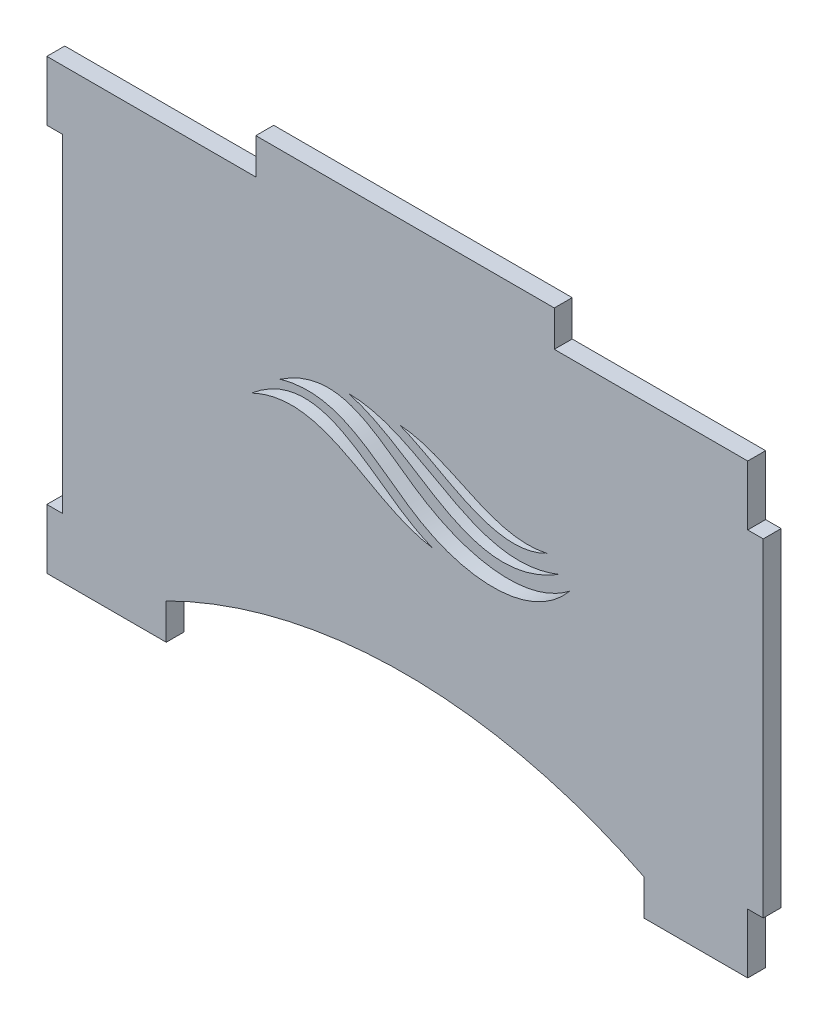
ISO-10303-21;
HEADER;
FILE_DESCRIPTION(('STEP AP214'),'2;1');
FILE_NAME('part.step','',(''),(''),'','','');
FILE_SCHEMA(('AUTOMOTIVE_DESIGN { 1 0 10303 214 1 1 1 1 }'));
ENDSEC;
DATA;
#1=APPLICATION_CONTEXT('core data for automotive mechanical design processes');
#2=APPLICATION_PROTOCOL_DEFINITION('international standard','automotive_design',2000,#1);
#3=PRODUCT_CONTEXT('',#1,'mechanical');
#4=PRODUCT('Part','Part','',(#3));
#5=PRODUCT_RELATED_PRODUCT_CATEGORY('part','',(#4));
#6=PRODUCT_DEFINITION_FORMATION('','',#4);
#7=PRODUCT_DEFINITION_CONTEXT('part definition',#1,'design');
#8=PRODUCT_DEFINITION('design','',#6,#7);
#9=PRODUCT_DEFINITION_SHAPE('','',#8);
#10=(LENGTH_UNIT() NAMED_UNIT(*) SI_UNIT(.MILLI.,.METRE.));
#11=(NAMED_UNIT(*) PLANE_ANGLE_UNIT() SI_UNIT($,.RADIAN.));
#12=(NAMED_UNIT(*) SI_UNIT($,.STERADIAN.) SOLID_ANGLE_UNIT());
#13=UNCERTAINTY_MEASURE_WITH_UNIT(LENGTH_MEASURE(1.E-05),#10,'distance_accuracy_value','');
#14=(GEOMETRIC_REPRESENTATION_CONTEXT(3) GLOBAL_UNCERTAINTY_ASSIGNED_CONTEXT((#13)) GLOBAL_UNIT_ASSIGNED_CONTEXT((#10,
#11,#12)) REPRESENTATION_CONTEXT('',''));
#15=CARTESIAN_POINT('',(0.,0.,0.));
#16=DIRECTION('',(0.,0.,1.));
#17=DIRECTION('',(1.,0.,0.));
#18=AXIS2_PLACEMENT_3D('',#15,#16,#17);
#19=CARTESIAN_POINT('',(0.,0.,3.));
#20=DIRECTION('',(0.,0.,-1.));
#21=DIRECTION('',(-1.,0.,0.));
#22=AXIS2_PLACEMENT_3D('',#19,#20,#21);
#23=PLANE('',#22);
#24=CARTESIAN_POINT('',(-24.4333985265473,-31.7116357940053,3.));
#25=CARTESIAN_POINT('',(-12.0868755885645,-21.3752233639132,3.));
#26=CARTESIAN_POINT('',(-4.14019309824819,-35.3582297749606,3.));
#27=CARTESIAN_POINT('',(5.97275965241098,-39.0224717089516,3.));
#28=B_SPLINE_CURVE_WITH_KNOTS('',3,(#24,#25,#26,#27),.UNSPECIFIED.,.F.,.F.,(4,4),(0.,1.),.UNSPECIFIED.);
#29=CARTESIAN_POINT('',(-24.4333985265473,-31.7116357940053,3.));
#30=VERTEX_POINT('',#29);
#31=CARTESIAN_POINT('',(5.97275965241098,-39.0224717089516,3.));
#32=VERTEX_POINT('',#31);
#33=EDGE_CURVE('E406',#30,#32,#28,.T.);
#34=ORIENTED_EDGE('',*,*,#33,.T.);
#35=CARTESIAN_POINT('',(5.97275965241098,-39.0224717089516,3.));
#36=CARTESIAN_POINT('',(-4.78665127300127,-37.542126637079,3.));
#37=CARTESIAN_POINT('',(-12.266801911344,-25.8915798457805,3.));
#38=CARTESIAN_POINT('',(-24.4333985265473,-31.7116357940053,3.));
#39=B_SPLINE_CURVE_WITH_KNOTS('',3,(#35,#36,#37,#38),.UNSPECIFIED.,.F.,.F.,(4,4),(0.,1.),.UNSPECIFIED.);
#40=EDGE_CURVE('E413',#32,#30,#39,.T.);
#41=ORIENTED_EDGE('',*,*,#40,.T.);
#42=EDGE_LOOP('',(#34,#41));
#43=FACE_BOUND('',#42,.T.);
#44=CARTESIAN_POINT('',(25.12591934899,-30.1784115919172,3.));
#45=CARTESIAN_POINT('',(16.4033129168845,-34.7892645078574,3.));
#46=CARTESIAN_POINT('',(7.80204591224323,-26.7598485053256,3.));
#47=CARTESIAN_POINT('',(0.374797507402158,-23.9122940143284,2.99999999999998));
#48=B_SPLINE_CURVE_WITH_KNOTS('',3,(#44,#45,#46,#47),.UNSPECIFIED.,.F.,.F.,(4,4),(0.,1.),.UNSPECIFIED.);
#49=CARTESIAN_POINT('',(25.12591934899,-30.1784115919172,3.));
#50=VERTEX_POINT('',#49);
#51=CARTESIAN_POINT('',(0.374797507402158,-23.9122940143284,2.99999999999998));
#52=VERTEX_POINT('',#51);
#53=EDGE_CURVE('E664',#50,#52,#48,.T.);
#54=ORIENTED_EDGE('',*,*,#53,.T.);
#55=CARTESIAN_POINT('',(0.374797507402158,-23.9122940143284,2.99999999999998));
#56=CARTESIAN_POINT('',(9.18016719220731,-24.4868190879793,3.));
#57=CARTESIAN_POINT('',(15.7739483838646,-32.3987665956965,3.));
#58=CARTESIAN_POINT('',(25.12591934899,-30.1784115919172,3.));
#59=B_SPLINE_CURVE_WITH_KNOTS('',3,(#55,#56,#57,#58),.UNSPECIFIED.,.F.,.F.,(4,4),(0.,1.),.UNSPECIFIED.);
#60=EDGE_CURVE('E671',#52,#50,#59,.T.);
#61=ORIENTED_EDGE('',*,*,#60,.T.);
#62=EDGE_LOOP('',(#54,#61));
#63=FACE_BOUND('',#62,.T.);
#64=CARTESIAN_POINT('',(28.893422577764,-33.7724686922463,3.00000000000003));
#65=CARTESIAN_POINT('',(22.7928815914827,-41.1921870334598,2.99999999999998));
#66=CARTESIAN_POINT('',(2.1411008927285,-40.4780917336509,3.));
#67=CARTESIAN_POINT('',(-8.73692936120792,-24.1378576761832,3.));
#68=CARTESIAN_POINT('',(-19.6338763660233,-27.3095771584664,3.));
#69=B_SPLINE_CURVE_WITH_KNOTS('',3,(#64,#65,#66,#67,#68),.UNSPECIFIED.,.F.,.F.,(4,1,4),(0.,
0.483960526883397,1.),.UNSPECIFIED.);
#70=CARTESIAN_POINT('',(28.893422577764,-33.7724686922463,3.00000000000003));
#71=VERTEX_POINT('',#70);
#72=CARTESIAN_POINT('',(-19.6338763660233,-27.3095771584664,3.));
#73=VERTEX_POINT('',#72);
#74=EDGE_CURVE('E712',#71,#73,#69,.T.);
#75=ORIENTED_EDGE('',*,*,#74,.T.);
#76=CARTESIAN_POINT('',(-19.6338763660233,-27.3095771584664,3.));
#77=CARTESIAN_POINT('',(-9.02342857661063,-20.1867869281244,3.00000000000003));
#78=CARTESIAN_POINT('',(2.40422951193817,-35.7492100264245,3.));
#79=CARTESIAN_POINT('',(21.9216727795484,-39.1581539151279,2.99999999999998));
#80=CARTESIAN_POINT('',(28.8934225777639,-33.7724686922463,3.));
#81=B_SPLINE_CURVE_WITH_KNOTS('',3,(#76,#77,#78,#79,#80),.UNSPECIFIED.,.F.,.F.,(4,1,4),(0.,
0.521405392099915,1.),.UNSPECIFIED.);
#82=EDGE_CURVE('E63',#73,#71,#81,.T.);
#83=ORIENTED_EDGE('',*,*,#82,.T.);
#84=EDGE_LOOP('',(#75,#83));
#85=FACE_BOUND('',#84,.T.);
#86=CARTESIAN_POINT('',(27.1251009407812,-32.2465304799772,2.99999999999998));
#87=CARTESIAN_POINT('',(12.4208012519135,-41.2866179051946,3.));
#88=CARTESIAN_POINT('',(3.78846593175513,-26.918738653697,2.99999999999995));
#89=CARTESIAN_POINT('',(-8.16981980393464,-23.6260174784738,3.));
#90=B_SPLINE_CURVE_WITH_KNOTS('',3,(#86,#87,#88,#89),.UNSPECIFIED.,.F.,.F.,(4,4),(0.,1.),.UNSPECIFIED.);
#91=CARTESIAN_POINT('',(27.1251009407812,-32.2465304799772,2.99999999999998));
#92=VERTEX_POINT('',#91);
#93=CARTESIAN_POINT('',(-8.16981980393464,-23.6260174784738,3.));
#94=VERTEX_POINT('',#93);
#95=EDGE_CURVE('E702',#92,#94,#90,.T.);
#96=ORIENTED_EDGE('',*,*,#95,.T.);
#97=CARTESIAN_POINT('',(-8.16981980393464,-23.6260174784738,3.));
#98=CARTESIAN_POINT('',(4.80016965699641,-23.7533365136554,3.));
#99=CARTESIAN_POINT('',(12.7202116091184,-38.015113151124,3.));
#100=CARTESIAN_POINT('',(27.1251009407812,-32.2465304799772,2.99999999999998));
#101=B_SPLINE_CURVE_WITH_KNOTS('',3,(#97,#98,#99,#100),.UNSPECIFIED.,.F.,.F.,(4,4),(0.,1.),.UNSPECIFIED.);
#102=EDGE_CURVE('E55',#94,#92,#101,.T.);
#103=ORIENTED_EDGE('',*,*,#102,.T.);
#104=EDGE_LOOP('',(#96,#103));
#105=FACE_BOUND('',#104,.T.);
#106=CARTESIAN_POINT('',(1.30000000000003,-149.,3.));
#107=DIRECTION('',(0.,0.,1.));
#108=DIRECTION('',(1.,0.,0.));
#109=AXIS2_PLACEMENT_3D('',#106,#107,#108);
#110=CIRCLE('',#109,89.4427190999916);
#111=CARTESIAN_POINT('',(41.3,-69.,2.99999999999995));
#112=VERTEX_POINT('',#111);
#113=CARTESIAN_POINT('',(-38.7,-69.,2.99999999999998));
#114=VERTEX_POINT('',#113);
#115=EDGE_CURVE('E223',#112,#114,#110,.T.);
#116=ORIENTED_EDGE('',*,*,#115,.F.);
#117=DIRECTION('',(0.,1.,0.));
#118=VECTOR('',#117,1.);
#119=CARTESIAN_POINT('',(41.3,-75.,2.99999999999995));
#120=LINE('',#119,#118);
#121=CARTESIAN_POINT('',(41.3,-75.,2.99999999999995));
#122=VERTEX_POINT('',#121);
#123=EDGE_CURVE('E250',#122,#112,#120,.T.);
#124=ORIENTED_EDGE('',*,*,#123,.F.);
#125=DIRECTION('',(-1.,0.,0.));
#126=VECTOR('',#125,1.);
#127=CARTESIAN_POINT('',(58.7,-75.,3.));
#128=LINE('',#127,#126);
#129=CARTESIAN_POINT('',(58.7,-75.,3.));
#130=VERTEX_POINT('',#129);
#131=EDGE_CURVE('E254',#130,#122,#128,.T.);
#132=ORIENTED_EDGE('',*,*,#131,.F.);
#133=DIRECTION('',(0.,-1.,0.));
#134=VECTOR('',#133,1.);
#135=CARTESIAN_POINT('',(58.7,-65.,3.));
#136=LINE('',#135,#134);
#137=CARTESIAN_POINT('',(58.7,-65.,3.));
#138=VERTEX_POINT('',#137);
#139=EDGE_CURVE('E351',#138,#130,#136,.T.);
#140=ORIENTED_EDGE('',*,*,#139,.F.);
#141=DIRECTION('',(-1.,0.,0.));
#142=VECTOR('',#141,1.);
#143=CARTESIAN_POINT('',(61.3,-65.,3.));
#144=LINE('',#143,#142);
#145=CARTESIAN_POINT('',(61.3,-65.,3.));
#146=VERTEX_POINT('',#145);
#147=EDGE_CURVE('E294',#146,#138,#144,.T.);
#148=ORIENTED_EDGE('',*,*,#147,.F.);
#149=DIRECTION('',(0.,-1.,0.));
#150=VECTOR('',#149,1.);
#151=CARTESIAN_POINT('',(61.3,-9.99999999999998,3.));
#152=LINE('',#151,#150);
#153=CARTESIAN_POINT('',(61.3,-9.99999999999998,3.));
#154=VERTEX_POINT('',#153);
#155=EDGE_CURVE('E291',#154,#146,#152,.T.);
#156=ORIENTED_EDGE('',*,*,#155,.F.);
#157=DIRECTION('',(1.,0.,0.));
#158=VECTOR('',#157,1.);
#159=CARTESIAN_POINT('',(58.7,-10.,2.99999999999995));
#160=LINE('',#159,#158);
#161=CARTESIAN_POINT('',(58.7,-10.,2.99999999999995));
#162=VERTEX_POINT('',#161);
#163=EDGE_CURVE('E288',#162,#154,#160,.T.);
#164=ORIENTED_EDGE('',*,*,#163,.F.);
#165=DIRECTION('',(0.,-1.,0.));
#166=VECTOR('',#165,1.);
#167=CARTESIAN_POINT('',(58.7,0.,2.99999999999995));
#168=LINE('',#167,#166);
#169=CARTESIAN_POINT('',(58.7,0.,2.99999999999995));
#170=VERTEX_POINT('',#169);
#171=EDGE_CURVE('E285',#170,#162,#168,.T.);
#172=ORIENTED_EDGE('',*,*,#171,.F.);
#173=DIRECTION('',(1.,0.,0.));
#174=VECTOR('',#173,1.);
#175=CARTESIAN_POINT('',(26.3,0.,2.99999999999998));
#176=LINE('',#175,#174);
#177=CARTESIAN_POINT('',(26.3,0.,2.99999999999998));
#178=VERTEX_POINT('',#177);
#179=EDGE_CURVE('E282',#178,#170,#176,.T.);
#180=ORIENTED_EDGE('',*,*,#179,.F.);
#181=DIRECTION('',(0.,-1.,0.));
#182=VECTOR('',#181,1.);
#183=CARTESIAN_POINT('',(26.3,6.00000000000001,2.99999999999998));
#184=LINE('',#183,#182);
#185=CARTESIAN_POINT('',(26.3,6.00000000000001,2.99999999999998));
#186=VERTEX_POINT('',#185);
#187=EDGE_CURVE('E279',#186,#178,#184,.T.);
#188=ORIENTED_EDGE('',*,*,#187,.F.);
#189=DIRECTION('',(1.,0.,0.));
#190=VECTOR('',#189,1.);
#191=CARTESIAN_POINT('',(-23.7,6.00000000000001,3.));
#192=LINE('',#191,#190);
#193=CARTESIAN_POINT('',(-23.7,6.00000000000001,3.));
#194=VERTEX_POINT('',#193);
#195=EDGE_CURVE('E276',#194,#186,#192,.T.);
#196=ORIENTED_EDGE('',*,*,#195,.F.);
#197=DIRECTION('',(0.,-1.,0.));
#198=VECTOR('',#197,1.);
#199=CARTESIAN_POINT('',(-23.7,6.00000000000001,3.));
#200=LINE('',#199,#198);
#201=CARTESIAN_POINT('',(-23.7,0.,3.));
#202=VERTEX_POINT('',#201);
#203=EDGE_CURVE('E274',#194,#202,#200,.T.);
#204=ORIENTED_EDGE('',*,*,#203,.T.);
#205=DIRECTION('',(-1.,0.,0.));
#206=VECTOR('',#205,1.);
#207=CARTESIAN_POINT('',(-23.7,0.,3.));
#208=LINE('',#207,#206);
#209=CARTESIAN_POINT('',(-58.7,0.,2.99999999999998));
#210=VERTEX_POINT('',#209);
#211=EDGE_CURVE('E272',#202,#210,#208,.T.);
#212=ORIENTED_EDGE('',*,*,#211,.T.);
#213=DIRECTION('',(0.,1.,0.));
#214=VECTOR('',#213,1.);
#215=CARTESIAN_POINT('',(-58.7,-10.,2.99999999999998));
#216=LINE('',#215,#214);
#217=CARTESIAN_POINT('',(-58.7,-10.,2.99999999999998));
#218=VERTEX_POINT('',#217);
#219=EDGE_CURVE('E269',#218,#210,#216,.T.);
#220=ORIENTED_EDGE('',*,*,#219,.F.);
#221=DIRECTION('',(-1.,0.,0.));
#222=VECTOR('',#221,1.);
#223=CARTESIAN_POINT('',(-56.1,-9.99999999999998,3.));
#224=LINE('',#223,#222);
#225=CARTESIAN_POINT('',(-56.1,-9.99999999999998,3.));
#226=VERTEX_POINT('',#225);
#227=EDGE_CURVE('E266',#226,#218,#224,.T.);
#228=ORIENTED_EDGE('',*,*,#227,.F.);
#229=DIRECTION('',(0.,1.,0.));
#230=VECTOR('',#229,1.);
#231=CARTESIAN_POINT('',(-56.1,-65.,3.00000000000003));
#232=LINE('',#231,#230);
#233=CARTESIAN_POINT('',(-56.1,-65.,3.00000000000003));
#234=VERTEX_POINT('',#233);
#235=EDGE_CURVE('E263',#234,#226,#232,.T.);
#236=ORIENTED_EDGE('',*,*,#235,.F.);
#237=DIRECTION('',(1.,0.,0.));
#238=VECTOR('',#237,1.);
#239=CARTESIAN_POINT('',(-58.7,-65.,2.99999999999998));
#240=LINE('',#239,#238);
#241=CARTESIAN_POINT('',(-58.7,-65.,2.99999999999998));
#242=VERTEX_POINT('',#241);
#243=EDGE_CURVE('E260',#242,#234,#240,.T.);
#244=ORIENTED_EDGE('',*,*,#243,.F.);
#245=DIRECTION('',(0.,1.,0.));
#246=VECTOR('',#245,1.);
#247=CARTESIAN_POINT('',(-58.7,-75.,2.99999999999998));
#248=LINE('',#247,#246);
#249=CARTESIAN_POINT('',(-58.7,-75.,2.99999999999998));
#250=VERTEX_POINT('',#249);
#251=EDGE_CURVE('E252',#250,#242,#248,.T.);
#252=ORIENTED_EDGE('',*,*,#251,.F.);
#253=DIRECTION('',(1.,0.,0.));
#254=VECTOR('',#253,1.);
#255=CARTESIAN_POINT('',(-58.7,-75.,2.99999999999998));
#256=LINE('',#255,#254);
#257=CARTESIAN_POINT('',(-38.7,-75.,2.99999999999998));
#258=VERTEX_POINT('',#257);
#259=EDGE_CURVE('E248',#250,#258,#256,.T.);
#260=ORIENTED_EDGE('',*,*,#259,.T.);
#261=DIRECTION('',(0.,-1.,0.));
#262=VECTOR('',#261,1.);
#263=CARTESIAN_POINT('',(-38.7,-69.,2.99999999999998));
#264=LINE('',#263,#262);
#265=EDGE_CURVE('E241',#114,#258,#264,.T.);
#266=ORIENTED_EDGE('',*,*,#265,.F.);
#267=EDGE_LOOP('',(#116,#124,#132,#140,#148,#156,#164,#172,#180,#188,#196,#204,#212,#220,#228,
#236,#244,#252,#260,#266));
#268=FACE_BOUND('',#267,.T.);
#269=ADVANCED_FACE('F38',(#43,#63,#85,#105,#268),#23,.F.);
#270=CARTESIAN_POINT('',(0.,0.,0.));
#271=DIRECTION('',(0.,0.,-1.));
#272=DIRECTION('',(-1.,0.,0.));
#273=AXIS2_PLACEMENT_3D('',#270,#271,#272);
#274=PLANE('',#273);
#275=CARTESIAN_POINT('',(-8.16981980393462,-23.6260174784738,0.));
#276=CARTESIAN_POINT('',(4.80016965699642,-23.7533365136554,0.));
#277=CARTESIAN_POINT('',(12.7202116091184,-38.015113151124,0.));
#278=CARTESIAN_POINT('',(27.1251009407812,-32.2465304799772,0.));
#279=B_SPLINE_CURVE_WITH_KNOTS('',3,(#275,#276,#277,#278),.UNSPECIFIED.,.F.,.F.,(4,4),(0.,1.),.UNSPECIFIED.);
#280=CARTESIAN_POINT('',(-8.16981980393462,-23.6260174784738,0.));
#281=VERTEX_POINT('',#280);
#282=CARTESIAN_POINT('',(27.1251009407812,-32.2465304799772,0.));
#283=VERTEX_POINT('',#282);
#284=EDGE_CURVE('E695',#281,#283,#279,.T.);
#285=ORIENTED_EDGE('',*,*,#284,.F.);
#286=CARTESIAN_POINT('',(27.1251009407812,-32.2465304799772,0.));
#287=CARTESIAN_POINT('',(12.4208012519135,-41.2866179051946,0.));
#288=CARTESIAN_POINT('',(3.78846593175514,-26.918738653697,0.));
#289=CARTESIAN_POINT('',(-8.16981980393462,-23.6260174784738,0.));
#290=B_SPLINE_CURVE_WITH_KNOTS('',3,(#286,#287,#288,#289),.UNSPECIFIED.,.F.,.F.,(4,4),(0.,1.),.UNSPECIFIED.);
#291=EDGE_CURVE('E703',#283,#281,#290,.T.);
#292=ORIENTED_EDGE('',*,*,#291,.F.);
#293=EDGE_LOOP('',(#285,#292));
#294=FACE_BOUND('',#293,.T.);
#295=CARTESIAN_POINT('',(-19.6338763660233,-27.3095771584664,0.));
#296=CARTESIAN_POINT('',(-9.02342857661066,-20.1867869281244,0.));
#297=CARTESIAN_POINT('',(2.40422951193817,-35.7492100264245,0.));
#298=CARTESIAN_POINT('',(21.9216727795484,-39.1581539151279,0.));
#299=CARTESIAN_POINT('',(28.8934225777639,-33.7724686922463,0.));
#300=B_SPLINE_CURVE_WITH_KNOTS('',3,(#295,#296,#297,#298,#299),.UNSPECIFIED.,.F.,.F.,(4,1,4),
(0.,0.521405392099915,1.),.UNSPECIFIED.);
#301=CARTESIAN_POINT('',(-19.6338763660233,-27.3095771584664,0.));
#302=VERTEX_POINT('',#301);
#303=CARTESIAN_POINT('',(28.893422577764,-33.7724686922463,0.));
#304=VERTEX_POINT('',#303);
#305=EDGE_CURVE('E723',#302,#304,#300,.T.);
#306=ORIENTED_EDGE('',*,*,#305,.F.);
#307=CARTESIAN_POINT('',(28.893422577764,-33.7724686922463,0.));
#308=CARTESIAN_POINT('',(22.7928815914828,-41.1921870334598,0.));
#309=CARTESIAN_POINT('',(2.14110089272851,-40.4780917336509,0.));
#310=CARTESIAN_POINT('',(-8.73692936120792,-24.1378576761832,0.));
#311=CARTESIAN_POINT('',(-19.6338763660233,-27.3095771584664,0.));
#312=B_SPLINE_CURVE_WITH_KNOTS('',3,(#307,#308,#309,#310,#311),.UNSPECIFIED.,.F.,.F.,(4,1,4),
(0.,0.483960526883397,1.),.UNSPECIFIED.);
#313=EDGE_CURVE('E730',#304,#302,#312,.T.);
#314=ORIENTED_EDGE('',*,*,#313,.F.);
#315=EDGE_LOOP('',(#306,#314));
#316=FACE_BOUND('',#315,.T.);
#317=CARTESIAN_POINT('',(0.374797507402144,-23.9122940143284,0.));
#318=CARTESIAN_POINT('',(9.1801671922073,-24.4868190879793,0.));
#319=CARTESIAN_POINT('',(15.7739483838646,-32.3987665956965,0.));
#320=CARTESIAN_POINT('',(25.12591934899,-30.1784115919172,0.));
#321=B_SPLINE_CURVE_WITH_KNOTS('',3,(#317,#318,#319,#320),.UNSPECIFIED.,.F.,.F.,(4,4),(0.,1.),.UNSPECIFIED.);
#322=CARTESIAN_POINT('',(0.374797507402144,-23.9122940143284,0.));
#323=VERTEX_POINT('',#322);
#324=CARTESIAN_POINT('',(25.12591934899,-30.1784115919172,0.));
#325=VERTEX_POINT('',#324);
#326=EDGE_CURVE('E234',#323,#325,#321,.T.);
#327=ORIENTED_EDGE('',*,*,#326,.F.);
#328=CARTESIAN_POINT('',(25.12591934899,-30.1784115919172,0.));
#329=CARTESIAN_POINT('',(16.4033129168845,-34.7892645078574,0.));
#330=CARTESIAN_POINT('',(7.80204591224323,-26.7598485053256,0.));
#331=CARTESIAN_POINT('',(0.374797507402144,-23.9122940143284,0.));
#332=B_SPLINE_CURVE_WITH_KNOTS('',3,(#328,#329,#330,#331),.UNSPECIFIED.,.F.,.F.,(4,4),(0.,1.),.UNSPECIFIED.);
#333=EDGE_CURVE('E682',#325,#323,#332,.T.);
#334=ORIENTED_EDGE('',*,*,#333,.F.);
#335=EDGE_LOOP('',(#327,#334));
#336=FACE_BOUND('',#335,.T.);
#337=CARTESIAN_POINT('',(5.97275965241099,-39.0224717089516,0.));
#338=CARTESIAN_POINT('',(-4.78665127300126,-37.542126637079,0.));
#339=CARTESIAN_POINT('',(-12.266801911344,-25.8915798457805,0.));
#340=CARTESIAN_POINT('',(-24.4333985265473,-31.7116357940053,0.));
#341=B_SPLINE_CURVE_WITH_KNOTS('',3,(#337,#338,#339,#340),.UNSPECIFIED.,.F.,.F.,(4,4),(0.,1.),.UNSPECIFIED.);
#342=CARTESIAN_POINT('',(5.97275965241099,-39.0224717089516,0.));
#343=VERTEX_POINT('',#342);
#344=CARTESIAN_POINT('',(-24.4333985265473,-31.7116357940053,0.));
#345=VERTEX_POINT('',#344);
#346=EDGE_CURVE('E414',#343,#345,#341,.T.);
#347=ORIENTED_EDGE('',*,*,#346,.F.);
#348=CARTESIAN_POINT('',(-24.4333985265473,-31.7116357940053,0.));
#349=CARTESIAN_POINT('',(-12.0868755885645,-21.3752233639132,0.));
#350=CARTESIAN_POINT('',(-4.14019309824823,-35.3582297749606,0.));
#351=CARTESIAN_POINT('',(5.97275965241099,-39.0224717089516,0.));
#352=B_SPLINE_CURVE_WITH_KNOTS('',3,(#348,#349,#350,#351),.UNSPECIFIED.,.F.,.F.,(4,4),(0.,1.),.UNSPECIFIED.);
#353=EDGE_CURVE('E408',#345,#343,#352,.T.);
#354=ORIENTED_EDGE('',*,*,#353,.F.);
#355=EDGE_LOOP('',(#347,#354));
#356=FACE_BOUND('',#355,.T.);
#357=DIRECTION('',(0.,1.,0.));
#358=VECTOR('',#357,1.);
#359=CARTESIAN_POINT('',(41.3,-75.,0.));
#360=LINE('',#359,#358);
#361=CARTESIAN_POINT('',(41.3,-75.,0.));
#362=VERTEX_POINT('',#361);
#363=CARTESIAN_POINT('',(41.3,-69.,0.));
#364=VERTEX_POINT('',#363);
#365=EDGE_CURVE('E304',#362,#364,#360,.T.);
#366=ORIENTED_EDGE('',*,*,#365,.T.);
#367=CARTESIAN_POINT('',(1.29999999999998,-149.,0.));
#368=DIRECTION('',(0.,0.,1.));
#369=DIRECTION('',(1.,0.,0.));
#370=AXIS2_PLACEMENT_3D('',#367,#368,#369);
#371=CIRCLE('',#370,89.4427190999916);
#372=CARTESIAN_POINT('',(-38.6999999999999,-69.,0.));
#373=VERTEX_POINT('',#372);
#374=EDGE_CURVE('E235',#364,#373,#371,.T.);
#375=ORIENTED_EDGE('',*,*,#374,.T.);
#376=DIRECTION('',(0.,-1.,0.));
#377=VECTOR('',#376,1.);
#378=CARTESIAN_POINT('',(-38.6999999999999,-69.,0.));
#379=LINE('',#378,#377);
#380=CARTESIAN_POINT('',(-38.7,-75.,0.));
#381=VERTEX_POINT('',#380);
#382=EDGE_CURVE('E243',#373,#381,#379,.T.);
#383=ORIENTED_EDGE('',*,*,#382,.T.);
#384=DIRECTION('',(1.,0.,0.));
#385=VECTOR('',#384,1.);
#386=CARTESIAN_POINT('',(-58.7,-75.,0.));
#387=LINE('',#386,#385);
#388=CARTESIAN_POINT('',(-58.7,-75.,0.));
#389=VERTEX_POINT('',#388);
#390=EDGE_CURVE('E308',#389,#381,#387,.T.);
#391=ORIENTED_EDGE('',*,*,#390,.F.);
#392=DIRECTION('',(0.,1.,0.));
#393=VECTOR('',#392,1.);
#394=CARTESIAN_POINT('',(-58.7,-75.,0.));
#395=LINE('',#394,#393);
#396=CARTESIAN_POINT('',(-58.7,-65.,0.));
#397=VERTEX_POINT('',#396);
#398=EDGE_CURVE('E311',#389,#397,#395,.T.);
#399=ORIENTED_EDGE('',*,*,#398,.T.);
#400=DIRECTION('',(1.,0.,0.));
#401=VECTOR('',#400,1.);
#402=CARTESIAN_POINT('',(-58.7,-65.,0.));
#403=LINE('',#402,#401);
#404=CARTESIAN_POINT('',(-56.1,-65.,0.));
#405=VERTEX_POINT('',#404);
#406=EDGE_CURVE('E314',#397,#405,#403,.T.);
#407=ORIENTED_EDGE('',*,*,#406,.T.);
#408=DIRECTION('',(0.,1.,0.));
#409=VECTOR('',#408,1.);
#410=CARTESIAN_POINT('',(-56.1,-65.,0.));
#411=LINE('',#410,#409);
#412=CARTESIAN_POINT('',(-56.1,-9.99999999999998,0.));
#413=VERTEX_POINT('',#412);
#414=EDGE_CURVE('E317',#405,#413,#411,.T.);
#415=ORIENTED_EDGE('',*,*,#414,.T.);
#416=DIRECTION('',(-1.,0.,0.));
#417=VECTOR('',#416,1.);
#418=CARTESIAN_POINT('',(-56.1,-9.99999999999998,0.));
#419=LINE('',#418,#417);
#420=CARTESIAN_POINT('',(-58.7,-10.,0.));
#421=VERTEX_POINT('',#420);
#422=EDGE_CURVE('E320',#413,#421,#419,.T.);
#423=ORIENTED_EDGE('',*,*,#422,.T.);
#424=DIRECTION('',(0.,1.,0.));
#425=VECTOR('',#424,1.);
#426=CARTESIAN_POINT('',(-58.7,-10.,0.));
#427=LINE('',#426,#425);
#428=CARTESIAN_POINT('',(-58.7,0.,0.));
#429=VERTEX_POINT('',#428);
#430=EDGE_CURVE('E323',#421,#429,#427,.T.);
#431=ORIENTED_EDGE('',*,*,#430,.T.);
#432=DIRECTION('',(-1.,0.,0.));
#433=VECTOR('',#432,1.);
#434=CARTESIAN_POINT('',(-23.7,0.,0.));
#435=LINE('',#434,#433);
#436=CARTESIAN_POINT('',(-23.7,0.,0.));
#437=VERTEX_POINT('',#436);
#438=EDGE_CURVE('E326',#437,#429,#435,.T.);
#439=ORIENTED_EDGE('',*,*,#438,.F.);
#440=DIRECTION('',(0.,-1.,0.));
#441=VECTOR('',#440,1.);
#442=CARTESIAN_POINT('',(-23.7,6.00000000000001,0.));
#443=LINE('',#442,#441);
#444=CARTESIAN_POINT('',(-23.7,6.00000000000001,0.));
#445=VERTEX_POINT('',#444);
#446=EDGE_CURVE('E329',#445,#437,#443,.T.);
#447=ORIENTED_EDGE('',*,*,#446,.F.);
#448=DIRECTION('',(1.,0.,0.));
#449=VECTOR('',#448,1.);
#450=CARTESIAN_POINT('',(-23.7,6.00000000000001,0.));
#451=LINE('',#450,#449);
#452=CARTESIAN_POINT('',(26.3,6.00000000000001,0.));
#453=VERTEX_POINT('',#452);
#454=EDGE_CURVE('E331',#445,#453,#451,.T.);
#455=ORIENTED_EDGE('',*,*,#454,.T.);
#456=DIRECTION('',(0.,-1.,0.));
#457=VECTOR('',#456,1.);
#458=CARTESIAN_POINT('',(26.3,6.00000000000001,0.));
#459=LINE('',#458,#457);
#460=CARTESIAN_POINT('',(26.3,0.,0.));
#461=VERTEX_POINT('',#460);
#462=EDGE_CURVE('E334',#453,#461,#459,.T.);
#463=ORIENTED_EDGE('',*,*,#462,.T.);
#464=DIRECTION('',(1.,0.,0.));
#465=VECTOR('',#464,1.);
#466=CARTESIAN_POINT('',(26.3,0.,0.));
#467=LINE('',#466,#465);
#468=CARTESIAN_POINT('',(58.7,0.,0.));
#469=VERTEX_POINT('',#468);
#470=EDGE_CURVE('E337',#461,#469,#467,.T.);
#471=ORIENTED_EDGE('',*,*,#470,.T.);
#472=DIRECTION('',(0.,-1.,0.));
#473=VECTOR('',#472,1.);
#474=CARTESIAN_POINT('',(58.7,0.,0.));
#475=LINE('',#474,#473);
#476=CARTESIAN_POINT('',(58.7,-10.,0.));
#477=VERTEX_POINT('',#476);
#478=EDGE_CURVE('E340',#469,#477,#475,.T.);
#479=ORIENTED_EDGE('',*,*,#478,.T.);
#480=DIRECTION('',(1.,0.,0.));
#481=VECTOR('',#480,1.);
#482=CARTESIAN_POINT('',(58.7,-10.,0.));
#483=LINE('',#482,#481);
#484=CARTESIAN_POINT('',(61.3,-9.99999999999998,0.));
#485=VERTEX_POINT('',#484);
#486=EDGE_CURVE('E343',#477,#485,#483,.T.);
#487=ORIENTED_EDGE('',*,*,#486,.T.);
#488=DIRECTION('',(0.,-1.,0.));
#489=VECTOR('',#488,1.);
#490=CARTESIAN_POINT('',(61.3,-9.99999999999998,0.));
#491=LINE('',#490,#489);
#492=CARTESIAN_POINT('',(61.3,-65.,0.));
#493=VERTEX_POINT('',#492);
#494=EDGE_CURVE('E346',#485,#493,#491,.T.);
#495=ORIENTED_EDGE('',*,*,#494,.T.);
#496=DIRECTION('',(-1.,0.,0.));
#497=VECTOR('',#496,1.);
#498=CARTESIAN_POINT('',(61.3,-65.,0.));
#499=LINE('',#498,#497);
#500=CARTESIAN_POINT('',(58.7,-65.,0.));
#501=VERTEX_POINT('',#500);
#502=EDGE_CURVE('E349',#493,#501,#499,.T.);
#503=ORIENTED_EDGE('',*,*,#502,.T.);
#504=DIRECTION('',(0.,-1.,0.));
#505=VECTOR('',#504,1.);
#506=CARTESIAN_POINT('',(58.7,-65.,0.));
#507=LINE('',#506,#505);
#508=CARTESIAN_POINT('',(58.7,-75.,0.));
#509=VERTEX_POINT('',#508);
#510=EDGE_CURVE('E297',#501,#509,#507,.T.);
#511=ORIENTED_EDGE('',*,*,#510,.T.);
#512=DIRECTION('',(-1.,0.,0.));
#513=VECTOR('',#512,1.);
#514=CARTESIAN_POINT('',(58.7,-75.,0.));
#515=LINE('',#514,#513);
#516=EDGE_CURVE('E300',#509,#362,#515,.T.);
#517=ORIENTED_EDGE('',*,*,#516,.T.);
#518=EDGE_LOOP('',(#366,#375,#383,#391,#399,#407,#415,#423,#431,#439,#447,#455,#463,#471,#479,
#487,#495,#503,#511,#517));
#519=FACE_BOUND('',#518,.T.);
#520=ADVANCED_FACE('F394',(#294,#316,#336,#356,#519),#274,.T.);
#521=CARTESIAN_POINT('',(58.7,-65.,3.));
#522=DIRECTION('',(1.,0.,0.));
#523=DIRECTION('',(0.,0.,-1.));
#524=AXIS2_PLACEMENT_3D('',#521,#522,#523);
#525=PLANE('',#524);
#526=ORIENTED_EDGE('',*,*,#510,.F.);
#527=DIRECTION('',(0.,0.,-1.));
#528=VECTOR('',#527,1.);
#529=CARTESIAN_POINT('',(58.7,-65.,3.));
#530=LINE('',#529,#528);
#531=EDGE_CURVE('E11',#138,#501,#530,.T.);
#532=ORIENTED_EDGE('',*,*,#531,.F.);
#533=ORIENTED_EDGE('',*,*,#139,.T.);
#534=DIRECTION('',(0.,0.,-1.));
#535=VECTOR('',#534,1.);
#536=CARTESIAN_POINT('',(58.7,-75.,3.));
#537=LINE('',#536,#535);
#538=EDGE_CURVE('E42',#130,#509,#537,.T.);
#539=ORIENTED_EDGE('',*,*,#538,.T.);
#540=EDGE_LOOP('',(#526,#532,#533,#539));
#541=FACE_BOUND('',#540,.T.);
#542=ADVANCED_FACE('F40',(#541),#525,.T.);
#543=CARTESIAN_POINT('',(61.3,-65.,3.));
#544=DIRECTION('',(0.,-1.,0.));
#545=DIRECTION('',(0.,0.,-1.));
#546=AXIS2_PLACEMENT_3D('',#543,#544,#545);
#547=PLANE('',#546);
#548=ORIENTED_EDGE('',*,*,#502,.F.);
#549=DIRECTION('',(0.,0.,-1.));
#550=VECTOR('',#549,1.);
#551=CARTESIAN_POINT('',(61.3,-65.,3.));
#552=LINE('',#551,#550);
#553=EDGE_CURVE('E47',#146,#493,#552,.T.);
#554=ORIENTED_EDGE('',*,*,#553,.F.);
#555=ORIENTED_EDGE('',*,*,#147,.T.);
#556=ORIENTED_EDGE('',*,*,#531,.T.);
#557=EDGE_LOOP('',(#548,#554,#555,#556));
#558=FACE_BOUND('',#557,.T.);
#559=ADVANCED_FACE('F398',(#558),#547,.T.);
#560=CARTESIAN_POINT('',(61.3,-9.99999999999998,3.));
#561=DIRECTION('',(1.,0.,0.));
#562=DIRECTION('',(0.,1.,0.));
#563=AXIS2_PLACEMENT_3D('',#560,#561,#562);
#564=PLANE('',#563);
#565=ORIENTED_EDGE('',*,*,#494,.F.);
#566=DIRECTION('',(0.,0.,-1.));
#567=VECTOR('',#566,1.);
#568=CARTESIAN_POINT('',(61.3,-9.99999999999998,3.));
#569=LINE('',#568,#567);
#570=EDGE_CURVE('E354',#154,#485,#569,.T.);
#571=ORIENTED_EDGE('',*,*,#570,.F.);
#572=ORIENTED_EDGE('',*,*,#155,.T.);
#573=ORIENTED_EDGE('',*,*,#553,.T.);
#574=EDGE_LOOP('',(#565,#571,#572,#573));
#575=FACE_BOUND('',#574,.T.);
#576=ADVANCED_FACE('F459',(#575),#564,.T.);
#577=CARTESIAN_POINT('',(58.7,-10.,2.99999999999995));
#578=DIRECTION('',(0.,1.,0.));
#579=DIRECTION('',(-1.,0.,0.));
#580=AXIS2_PLACEMENT_3D('',#577,#578,#579);
#581=PLANE('',#580);
#582=ORIENTED_EDGE('',*,*,#486,.F.);
#583=DIRECTION('',(0.,0.,-1.));
#584=VECTOR('',#583,1.);
#585=CARTESIAN_POINT('',(58.7,-10.,2.99999999999995));
#586=LINE('',#585,#584);
#587=EDGE_CURVE('E356',#162,#477,#586,.T.);
#588=ORIENTED_EDGE('',*,*,#587,.F.);
#589=ORIENTED_EDGE('',*,*,#163,.T.);
#590=ORIENTED_EDGE('',*,*,#570,.T.);
#591=EDGE_LOOP('',(#582,#588,#589,#590));
#592=FACE_BOUND('',#591,.T.);
#593=ADVANCED_FACE('F462',(#592),#581,.T.);
#594=CARTESIAN_POINT('',(58.7,0.,2.99999999999995));
#595=DIRECTION('',(1.,0.,0.));
#596=DIRECTION('',(0.,0.,-1.));
#597=AXIS2_PLACEMENT_3D('',#594,#595,#596);
#598=PLANE('',#597);
#599=ORIENTED_EDGE('',*,*,#478,.F.);
#600=DIRECTION('',(0.,0.,-1.));
#601=VECTOR('',#600,1.);
#602=CARTESIAN_POINT('',(58.7,0.,2.99999999999995));
#603=LINE('',#602,#601);
#604=EDGE_CURVE('E358',#170,#469,#603,.T.);
#605=ORIENTED_EDGE('',*,*,#604,.F.);
#606=ORIENTED_EDGE('',*,*,#171,.T.);
#607=ORIENTED_EDGE('',*,*,#587,.T.);
#608=EDGE_LOOP('',(#599,#605,#606,#607));
#609=FACE_BOUND('',#608,.T.);
#610=ADVANCED_FACE('F466',(#609),#598,.T.);
#611=CARTESIAN_POINT('',(26.3,0.,2.99999999999998));
#612=DIRECTION('',(0.,1.,0.));
#613=DIRECTION('',(-1.,0.,0.));
#614=AXIS2_PLACEMENT_3D('',#611,#612,#613);
#615=PLANE('',#614);
#616=ORIENTED_EDGE('',*,*,#470,.F.);
#617=DIRECTION('',(0.,0.,-1.));
#618=VECTOR('',#617,1.);
#619=CARTESIAN_POINT('',(26.3,0.,2.99999999999998));
#620=LINE('',#619,#618);
#621=EDGE_CURVE('E360',#178,#461,#620,.T.);
#622=ORIENTED_EDGE('',*,*,#621,.F.);
#623=ORIENTED_EDGE('',*,*,#179,.T.);
#624=ORIENTED_EDGE('',*,*,#604,.T.);
#625=EDGE_LOOP('',(#616,#622,#623,#624));
#626=FACE_BOUND('',#625,.T.);
#627=ADVANCED_FACE('F470',(#626),#615,.T.);
#628=CARTESIAN_POINT('',(26.3,6.00000000000001,2.99999999999998));
#629=DIRECTION('',(1.,0.,0.));
#630=DIRECTION('',(0.,0.,-1.));
#631=AXIS2_PLACEMENT_3D('',#628,#629,#630);
#632=PLANE('',#631);
#633=ORIENTED_EDGE('',*,*,#462,.F.);
#634=DIRECTION('',(0.,0.,-1.));
#635=VECTOR('',#634,1.);
#636=CARTESIAN_POINT('',(26.3,6.00000000000001,2.99999999999998));
#637=LINE('',#636,#635);
#638=EDGE_CURVE('E362',#186,#453,#637,.T.);
#639=ORIENTED_EDGE('',*,*,#638,.F.);
#640=ORIENTED_EDGE('',*,*,#187,.T.);
#641=ORIENTED_EDGE('',*,*,#621,.T.);
#642=EDGE_LOOP('',(#633,#639,#640,#641));
#643=FACE_BOUND('',#642,.T.);
#644=ADVANCED_FACE('F474',(#643),#632,.T.);
#645=CARTESIAN_POINT('',(-23.7,6.00000000000001,3.));
#646=DIRECTION('',(0.,1.,0.));
#647=DIRECTION('',(0.,0.,1.));
#648=AXIS2_PLACEMENT_3D('',#645,#646,#647);
#649=PLANE('',#648);
#650=ORIENTED_EDGE('',*,*,#454,.F.);
#651=DIRECTION('',(0.,0.,-1.));
#652=VECTOR('',#651,1.);
#653=CARTESIAN_POINT('',(-23.7,6.00000000000001,3.));
#654=LINE('',#653,#652);
#655=EDGE_CURVE('E364',#194,#445,#654,.T.);
#656=ORIENTED_EDGE('',*,*,#655,.F.);
#657=ORIENTED_EDGE('',*,*,#195,.T.);
#658=ORIENTED_EDGE('',*,*,#638,.T.);
#659=EDGE_LOOP('',(#650,#656,#657,#658));
#660=FACE_BOUND('',#659,.T.);
#661=ADVANCED_FACE('F478',(#660),#649,.T.);
#662=CARTESIAN_POINT('',(-23.7,6.00000000000001,3.));
#663=DIRECTION('',(1.,0.,0.));
#664=DIRECTION('',(0.,0.,-1.));
#665=AXIS2_PLACEMENT_3D('',#662,#663,#664);
#666=PLANE('',#665);
#667=ORIENTED_EDGE('',*,*,#446,.T.);
#668=DIRECTION('',(0.,0.,-1.));
#669=VECTOR('',#668,1.);
#670=CARTESIAN_POINT('',(-23.7,0.,3.));
#671=LINE('',#670,#669);
#672=EDGE_CURVE('E366',#202,#437,#671,.T.);
#673=ORIENTED_EDGE('',*,*,#672,.F.);
#674=ORIENTED_EDGE('',*,*,#203,.F.);
#675=ORIENTED_EDGE('',*,*,#655,.T.);
#676=EDGE_LOOP('',(#667,#673,#674,#675));
#677=FACE_BOUND('',#676,.T.);
#678=ADVANCED_FACE('F482',(#677),#666,.F.);
#679=CARTESIAN_POINT('',(-23.7,0.,3.));
#680=DIRECTION('',(0.,-1.,0.));
#681=DIRECTION('',(1.,0.,0.));
#682=AXIS2_PLACEMENT_3D('',#679,#680,#681);
#683=PLANE('',#682);
#684=ORIENTED_EDGE('',*,*,#438,.T.);
#685=DIRECTION('',(0.,0.,-1.));
#686=VECTOR('',#685,1.);
#687=CARTESIAN_POINT('',(-58.7,0.,2.99999999999998));
#688=LINE('',#687,#686);
#689=EDGE_CURVE('E369',#210,#429,#688,.T.);
#690=ORIENTED_EDGE('',*,*,#689,.F.);
#691=ORIENTED_EDGE('',*,*,#211,.F.);
#692=ORIENTED_EDGE('',*,*,#672,.T.);
#693=EDGE_LOOP('',(#684,#690,#691,#692));
#694=FACE_BOUND('',#693,.T.);
#695=ADVANCED_FACE('F486',(#694),#683,.F.);
#696=CARTESIAN_POINT('',(-58.7,-10.,2.99999999999998));
#697=DIRECTION('',(-1.,0.,0.));
#698=DIRECTION('',(0.,0.,1.));
#699=AXIS2_PLACEMENT_3D('',#696,#697,#698);
#700=PLANE('',#699);
#701=ORIENTED_EDGE('',*,*,#430,.F.);
#702=DIRECTION('',(0.,0.,-1.));
#703=VECTOR('',#702,1.);
#704=CARTESIAN_POINT('',(-58.7,-10.,2.99999999999998));
#705=LINE('',#704,#703);
#706=EDGE_CURVE('E371',#218,#421,#705,.T.);
#707=ORIENTED_EDGE('',*,*,#706,.F.);
#708=ORIENTED_EDGE('',*,*,#219,.T.);
#709=ORIENTED_EDGE('',*,*,#689,.T.);
#710=EDGE_LOOP('',(#701,#707,#708,#709));
#711=FACE_BOUND('',#710,.T.);
#712=ADVANCED_FACE('F490',(#711),#700,.T.);
#713=CARTESIAN_POINT('',(-56.1,-9.99999999999998,3.));
#714=DIRECTION('',(0.,-1.,0.));
#715=DIRECTION('',(1.,0.,0.));
#716=AXIS2_PLACEMENT_3D('',#713,#714,#715);
#717=PLANE('',#716);
#718=ORIENTED_EDGE('',*,*,#422,.F.);
#719=DIRECTION('',(0.,0.,-1.));
#720=VECTOR('',#719,1.);
#721=CARTESIAN_POINT('',(-56.1,-9.99999999999998,3.));
#722=LINE('',#721,#720);
#723=EDGE_CURVE('E373',#226,#413,#722,.T.);
#724=ORIENTED_EDGE('',*,*,#723,.F.);
#725=ORIENTED_EDGE('',*,*,#227,.T.);
#726=ORIENTED_EDGE('',*,*,#706,.T.);
#727=EDGE_LOOP('',(#718,#724,#725,#726));
#728=FACE_BOUND('',#727,.T.);
#729=ADVANCED_FACE('F494',(#728),#717,.T.);
#730=CARTESIAN_POINT('',(-56.1,-65.,3.00000000000003));
#731=DIRECTION('',(-1.,0.,0.));
#732=DIRECTION('',(0.,-1.,0.));
#733=AXIS2_PLACEMENT_3D('',#730,#731,#732);
#734=PLANE('',#733);
#735=ORIENTED_EDGE('',*,*,#414,.F.);
#736=DIRECTION('',(0.,0.,-1.));
#737=VECTOR('',#736,1.);
#738=CARTESIAN_POINT('',(-56.1,-65.,3.00000000000003));
#739=LINE('',#738,#737);
#740=EDGE_CURVE('E375',#234,#405,#739,.T.);
#741=ORIENTED_EDGE('',*,*,#740,.F.);
#742=ORIENTED_EDGE('',*,*,#235,.T.);
#743=ORIENTED_EDGE('',*,*,#723,.T.);
#744=EDGE_LOOP('',(#735,#741,#742,#743));
#745=FACE_BOUND('',#744,.T.);
#746=ADVANCED_FACE('F498',(#745),#734,.T.);
#747=CARTESIAN_POINT('',(-58.7,-65.,2.99999999999998));
#748=DIRECTION('',(0.,1.,0.));
#749=DIRECTION('',(-1.,0.,0.));
#750=AXIS2_PLACEMENT_3D('',#747,#748,#749);
#751=PLANE('',#750);
#752=ORIENTED_EDGE('',*,*,#406,.F.);
#753=DIRECTION('',(0.,0.,-1.));
#754=VECTOR('',#753,1.);
#755=CARTESIAN_POINT('',(-58.7,-65.,2.99999999999998));
#756=LINE('',#755,#754);
#757=EDGE_CURVE('E377',#242,#397,#756,.T.);
#758=ORIENTED_EDGE('',*,*,#757,.F.);
#759=ORIENTED_EDGE('',*,*,#243,.T.);
#760=ORIENTED_EDGE('',*,*,#740,.T.);
#761=EDGE_LOOP('',(#752,#758,#759,#760));
#762=FACE_BOUND('',#761,.T.);
#763=ADVANCED_FACE('F502',(#762),#751,.T.);
#764=CARTESIAN_POINT('',(-58.7,-75.,2.99999999999998));
#765=DIRECTION('',(-1.,0.,0.));
#766=DIRECTION('',(0.,0.,1.));
#767=AXIS2_PLACEMENT_3D('',#764,#765,#766);
#768=PLANE('',#767);
#769=ORIENTED_EDGE('',*,*,#398,.F.);
#770=DIRECTION('',(0.,0.,-1.));
#771=VECTOR('',#770,1.);
#772=CARTESIAN_POINT('',(-58.7,-75.,2.99999999999998));
#773=LINE('',#772,#771);
#774=EDGE_CURVE('E379',#250,#389,#773,.T.);
#775=ORIENTED_EDGE('',*,*,#774,.F.);
#776=ORIENTED_EDGE('',*,*,#251,.T.);
#777=ORIENTED_EDGE('',*,*,#757,.T.);
#778=EDGE_LOOP('',(#769,#775,#776,#777));
#779=FACE_BOUND('',#778,.T.);
#780=ADVANCED_FACE('F506',(#779),#768,.T.);
#781=CARTESIAN_POINT('',(-58.7,-75.,2.99999999999998));
#782=DIRECTION('',(0.,1.,0.));
#783=DIRECTION('',(0.,0.,1.));
#784=AXIS2_PLACEMENT_3D('',#781,#782,#783);
#785=PLANE('',#784);
#786=ORIENTED_EDGE('',*,*,#390,.T.);
#787=DIRECTION('',(0.,0.,-1.));
#788=VECTOR('',#787,1.);
#789=CARTESIAN_POINT('',(-38.7,-75.,2.99999999999998));
#790=LINE('',#789,#788);
#791=EDGE_CURVE('E244',#258,#381,#790,.T.);
#792=ORIENTED_EDGE('',*,*,#791,.F.);
#793=ORIENTED_EDGE('',*,*,#259,.F.);
#794=ORIENTED_EDGE('',*,*,#774,.T.);
#795=EDGE_LOOP('',(#786,#792,#793,#794));
#796=FACE_BOUND('',#795,.T.);
#797=ADVANCED_FACE('F510',(#796),#785,.F.);
#798=CARTESIAN_POINT('',(-38.7,-69.,2.99999999999998));
#799=DIRECTION('',(1.,0.,0.));
#800=DIRECTION('',(0.,0.,-1.));
#801=AXIS2_PLACEMENT_3D('',#798,#799,#800);
#802=PLANE('',#801);
#803=ORIENTED_EDGE('',*,*,#382,.F.);
#804=DIRECTION('',(0.,0.,-1.));
#805=VECTOR('',#804,1.);
#806=CARTESIAN_POINT('',(-38.7,-69.,2.99999999999998));
#807=LINE('',#806,#805);
#808=EDGE_CURVE('E226',#114,#373,#807,.T.);
#809=ORIENTED_EDGE('',*,*,#808,.F.);
#810=ORIENTED_EDGE('',*,*,#265,.T.);
#811=ORIENTED_EDGE('',*,*,#791,.T.);
#812=EDGE_LOOP('',(#803,#809,#810,#811));
#813=FACE_BOUND('',#812,.T.);
#814=ADVANCED_FACE('F240',(#813),#802,.T.);
#815=CARTESIAN_POINT('',(41.3,-75.,2.99999999999995));
#816=DIRECTION('',(-1.,0.,0.));
#817=DIRECTION('',(0.,0.,1.));
#818=AXIS2_PLACEMENT_3D('',#815,#816,#817);
#819=PLANE('',#818);
#820=ORIENTED_EDGE('',*,*,#365,.F.);
#821=DIRECTION('',(0.,0.,-1.));
#822=VECTOR('',#821,1.);
#823=CARTESIAN_POINT('',(41.3,-75.,2.99999999999995));
#824=LINE('',#823,#822);
#825=EDGE_CURVE('E382',#122,#362,#824,.T.);
#826=ORIENTED_EDGE('',*,*,#825,.F.);
#827=ORIENTED_EDGE('',*,*,#123,.T.);
#828=DIRECTION('',(0.,0.,-1.));
#829=VECTOR('',#828,1.);
#830=CARTESIAN_POINT('',(41.3,-69.,2.99999999999995));
#831=LINE('',#830,#829);
#832=EDGE_CURVE('E229',#112,#364,#831,.T.);
#833=ORIENTED_EDGE('',*,*,#832,.T.);
#834=EDGE_LOOP('',(#820,#826,#827,#833));
#835=FACE_BOUND('',#834,.T.);
#836=ADVANCED_FACE('F517',(#835),#819,.T.);
#837=CARTESIAN_POINT('',(58.7,-75.,3.));
#838=DIRECTION('',(0.,-1.,0.));
#839=DIRECTION('',(0.,0.,-1.));
#840=AXIS2_PLACEMENT_3D('',#837,#838,#839);
#841=PLANE('',#840);
#842=ORIENTED_EDGE('',*,*,#516,.F.);
#843=ORIENTED_EDGE('',*,*,#538,.F.);
#844=ORIENTED_EDGE('',*,*,#131,.T.);
#845=ORIENTED_EDGE('',*,*,#825,.T.);
#846=EDGE_LOOP('',(#842,#843,#844,#845));
#847=FACE_BOUND('',#846,.T.);
#848=ADVANCED_FACE('F392',(#847),#841,.T.);
#849=DIRECTION('',(0.,0.,-1.));
#850=VECTOR('',#849,1.);
#851=SURFACE_OF_LINEAR_EXTRUSION('',#39,#850);
#852=ORIENTED_EDGE('',*,*,#346,.T.);
#853=DIRECTION('',(0.,0.,-1.));
#854=VECTOR('',#853,1.);
#855=CARTESIAN_POINT('',(-24.4333985265473,-31.7116357940053,3.));
#856=LINE('',#855,#854);
#857=EDGE_CURVE('E403',#30,#345,#856,.T.);
#858=ORIENTED_EDGE('',*,*,#857,.F.);
#859=ORIENTED_EDGE('',*,*,#40,.F.);
#860=DIRECTION('',(0.,0.,-1.));
#861=VECTOR('',#860,1.);
#862=CARTESIAN_POINT('',(5.97275965241098,-39.0224717089516,3.));
#863=LINE('',#862,#861);
#864=EDGE_CURVE('E301',#32,#343,#863,.T.);
#865=ORIENTED_EDGE('',*,*,#864,.T.);
#866=EDGE_LOOP('',(#852,#858,#859,#865));
#867=FACE_BOUND('',#866,.T.);
#868=ADVANCED_FACE('F443',(#867),#851,.F.);
#869=DIRECTION('',(0.,0.,-1.));
#870=VECTOR('',#869,1.);
#871=SURFACE_OF_LINEAR_EXTRUSION('',#28,#870);
#872=ORIENTED_EDGE('',*,*,#353,.T.);
#873=ORIENTED_EDGE('',*,*,#864,.F.);
#874=ORIENTED_EDGE('',*,*,#33,.F.);
#875=ORIENTED_EDGE('',*,*,#857,.T.);
#876=EDGE_LOOP('',(#872,#873,#874,#875));
#877=FACE_BOUND('',#876,.T.);
#878=ADVANCED_FACE('F438',(#877),#871,.F.);
#879=DIRECTION('',(0.,0.,-1.));
#880=VECTOR('',#879,1.);
#881=SURFACE_OF_LINEAR_EXTRUSION('',#59,#880);
#882=ORIENTED_EDGE('',*,*,#326,.T.);
#883=DIRECTION('',(0.,0.,-1.));
#884=VECTOR('',#883,1.);
#885=CARTESIAN_POINT('',(25.12591934899,-30.1784115919172,3.));
#886=LINE('',#885,#884);
#887=EDGE_CURVE('E670',#50,#325,#886,.T.);
#888=ORIENTED_EDGE('',*,*,#887,.F.);
#889=ORIENTED_EDGE('',*,*,#60,.F.);
#890=DIRECTION('',(0.,0.,-1.));
#891=VECTOR('',#890,1.);
#892=CARTESIAN_POINT('',(0.374797507402158,-23.9122940143284,2.99999999999998));
#893=LINE('',#892,#891);
#894=EDGE_CURVE('E690',#52,#323,#893,.T.);
#895=ORIENTED_EDGE('',*,*,#894,.T.);
#896=EDGE_LOOP('',(#882,#888,#889,#895));
#897=FACE_BOUND('',#896,.T.);
#898=ADVANCED_FACE('F442',(#897),#881,.F.);
#899=DIRECTION('',(0.,0.,-1.));
#900=VECTOR('',#899,1.);
#901=SURFACE_OF_LINEAR_EXTRUSION('',#48,#900);
#902=ORIENTED_EDGE('',*,*,#333,.T.);
#903=ORIENTED_EDGE('',*,*,#894,.F.);
#904=ORIENTED_EDGE('',*,*,#53,.F.);
#905=ORIENTED_EDGE('',*,*,#887,.T.);
#906=EDGE_LOOP('',(#902,#903,#904,#905));
#907=FACE_BOUND('',#906,.T.);
#908=ADVANCED_FACE('F539',(#907),#901,.F.);
#909=DIRECTION('',(0.,0.,-1.));
#910=VECTOR('',#909,1.);
#911=SURFACE_OF_LINEAR_EXTRUSION('',#81,#910);
#912=ORIENTED_EDGE('',*,*,#305,.T.);
#913=DIRECTION('',(0.,0.,-1.));
#914=VECTOR('',#913,1.);
#915=CARTESIAN_POINT('',(28.893422577764,-33.7724686922463,3.00000000000003));
#916=LINE('',#915,#914);
#917=EDGE_CURVE('E718',#71,#304,#916,.T.);
#918=ORIENTED_EDGE('',*,*,#917,.F.);
#919=ORIENTED_EDGE('',*,*,#82,.F.);
#920=DIRECTION('',(0.,0.,-1.));
#921=VECTOR('',#920,1.);
#922=CARTESIAN_POINT('',(-19.6338763660233,-27.3095771584664,3.));
#923=LINE('',#922,#921);
#924=EDGE_CURVE('E421',#73,#302,#923,.T.);
#925=ORIENTED_EDGE('',*,*,#924,.T.);
#926=EDGE_LOOP('',(#912,#918,#919,#925));
#927=FACE_BOUND('',#926,.T.);
#928=ADVANCED_FACE('F445',(#927),#911,.F.);
#929=DIRECTION('',(0.,0.,-1.));
#930=VECTOR('',#929,1.);
#931=SURFACE_OF_LINEAR_EXTRUSION('',#69,#930);
#932=ORIENTED_EDGE('',*,*,#313,.T.);
#933=ORIENTED_EDGE('',*,*,#924,.F.);
#934=ORIENTED_EDGE('',*,*,#74,.F.);
#935=ORIENTED_EDGE('',*,*,#917,.T.);
#936=EDGE_LOOP('',(#932,#933,#934,#935));
#937=FACE_BOUND('',#936,.T.);
#938=ADVANCED_FACE('F554',(#937),#931,.F.);
#939=DIRECTION('',(0.,0.,-1.));
#940=VECTOR('',#939,1.);
#941=SURFACE_OF_LINEAR_EXTRUSION('',#101,#940);
#942=ORIENTED_EDGE('',*,*,#284,.T.);
#943=DIRECTION('',(0.,0.,-1.));
#944=VECTOR('',#943,1.);
#945=CARTESIAN_POINT('',(27.1251009407812,-32.2465304799772,2.99999999999998));
#946=LINE('',#945,#944);
#947=EDGE_CURVE('E753',#92,#283,#946,.T.);
#948=ORIENTED_EDGE('',*,*,#947,.F.);
#949=ORIENTED_EDGE('',*,*,#102,.F.);
#950=DIRECTION('',(0.,0.,-1.));
#951=VECTOR('',#950,1.);
#952=CARTESIAN_POINT('',(-8.16981980393464,-23.6260174784738,3.));
#953=LINE('',#952,#951);
#954=EDGE_CURVE('E731',#94,#281,#953,.T.);
#955=ORIENTED_EDGE('',*,*,#954,.T.);
#956=EDGE_LOOP('',(#942,#948,#949,#955));
#957=FACE_BOUND('',#956,.T.);
#958=ADVANCED_FACE('F560',(#957),#941,.F.);
#959=DIRECTION('',(0.,0.,-1.));
#960=VECTOR('',#959,1.);
#961=SURFACE_OF_LINEAR_EXTRUSION('',#90,#960);
#962=ORIENTED_EDGE('',*,*,#291,.T.);
#963=ORIENTED_EDGE('',*,*,#954,.F.);
#964=ORIENTED_EDGE('',*,*,#95,.F.);
#965=ORIENTED_EDGE('',*,*,#947,.T.);
#966=EDGE_LOOP('',(#962,#963,#964,#965));
#967=FACE_BOUND('',#966,.T.);
#968=ADVANCED_FACE('F567',(#967),#961,.F.);
#969=CARTESIAN_POINT('',(1.30000000000003,-149.,3.));
#970=DIRECTION('',(0.,0.,-1.));
#971=DIRECTION('',(-1.,0.,0.));
#972=AXIS2_PLACEMENT_3D('',#969,#970,#971);
#973=CYLINDRICAL_SURFACE('',#972,89.4427190999916);
#974=ORIENTED_EDGE('',*,*,#374,.F.);
#975=ORIENTED_EDGE('',*,*,#832,.F.);
#976=ORIENTED_EDGE('',*,*,#115,.T.);
#977=ORIENTED_EDGE('',*,*,#808,.T.);
#978=EDGE_LOOP('',(#974,#975,#976,#977));
#979=FACE_BOUND('',#978,.T.);
#980=ADVANCED_FACE('F225',(#979),#973,.F.);
#981=CLOSED_SHELL('',(#269,#520,#542,#559,#576,#593,#610,#627,#644,#661,#678,#695,#712,#729,
#746,#763,#780,#797,#814,#836,#848,#868,#878,#898,#908,#928,#938,#958,#968,#980));
#982=MANIFOLD_SOLID_BREP('B2',#981);
#983=ADVANCED_BREP_SHAPE_REPRESENTATION('',(#18,#982),#14);
#984=SHAPE_DEFINITION_REPRESENTATION(#9,#983);
ENDSEC;
END-ISO-10303-21;
